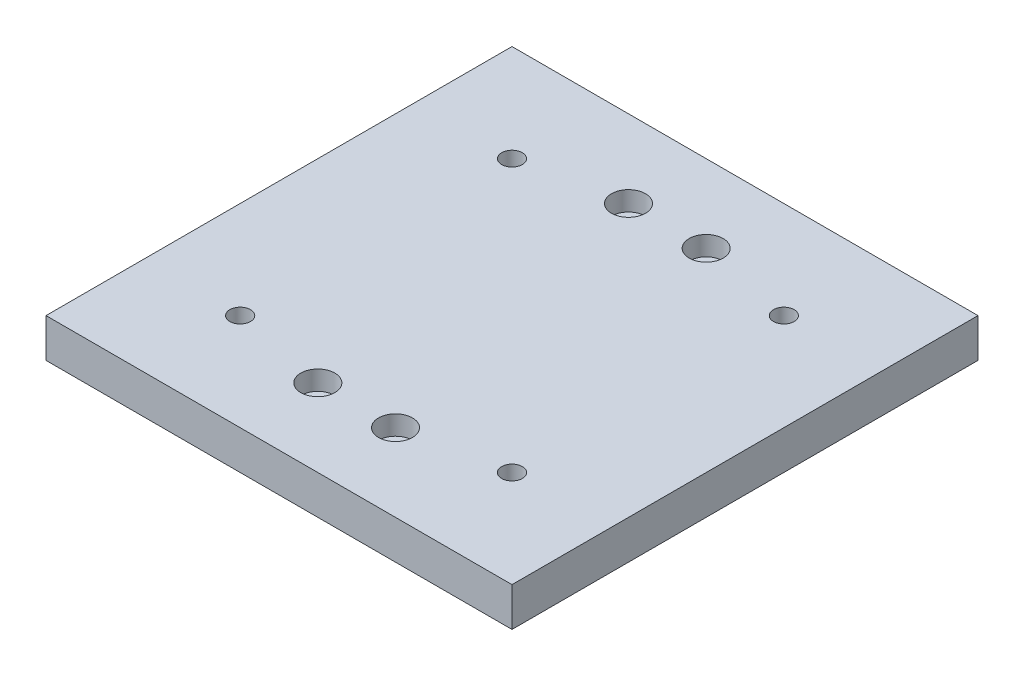
ISO-10303-21;
HEADER;
FILE_DESCRIPTION(('STEP AP214'),'2;1');
FILE_NAME('part.step','',(''),(''),'','','');
FILE_SCHEMA(('AUTOMOTIVE_DESIGN { 1 0 10303 214 1 1 1 1 }'));
ENDSEC;
DATA;
#1=APPLICATION_CONTEXT('core data for automotive mechanical design processes');
#2=APPLICATION_PROTOCOL_DEFINITION('international standard','automotive_design',2000,#1);
#3=PRODUCT_CONTEXT('',#1,'mechanical');
#4=PRODUCT('Part','Part','',(#3));
#5=PRODUCT_RELATED_PRODUCT_CATEGORY('part','',(#4));
#6=PRODUCT_DEFINITION_FORMATION('','',#4);
#7=PRODUCT_DEFINITION_CONTEXT('part definition',#1,'design');
#8=PRODUCT_DEFINITION('design','',#6,#7);
#9=PRODUCT_DEFINITION_SHAPE('','',#8);
#10=(LENGTH_UNIT() NAMED_UNIT(*) SI_UNIT(.MILLI.,.METRE.));
#11=(NAMED_UNIT(*) PLANE_ANGLE_UNIT() SI_UNIT($,.RADIAN.));
#12=(NAMED_UNIT(*) SI_UNIT($,.STERADIAN.) SOLID_ANGLE_UNIT());
#13=UNCERTAINTY_MEASURE_WITH_UNIT(LENGTH_MEASURE(1.E-05),#10,'distance_accuracy_value','');
#14=(GEOMETRIC_REPRESENTATION_CONTEXT(3) GLOBAL_UNCERTAINTY_ASSIGNED_CONTEXT((#13)) GLOBAL_UNIT_ASSIGNED_CONTEXT((#10,
#11,#12)) REPRESENTATION_CONTEXT('',''));
#15=CARTESIAN_POINT('',(0.,0.,0.));
#16=DIRECTION('',(0.,0.,1.));
#17=DIRECTION('',(1.,0.,0.));
#18=AXIS2_PLACEMENT_3D('',#15,#16,#17);
#19=CARTESIAN_POINT('',(-76.2,12.7,-76.2));
#20=DIRECTION('',(1.,0.,0.));
#21=DIRECTION('',(0.,0.,-1.));
#22=AXIS2_PLACEMENT_3D('',#19,#20,#21);
#23=PLANE('',#22);
#24=DIRECTION('',(0.,0.,1.));
#25=VECTOR('',#24,1.);
#26=CARTESIAN_POINT('',(-76.2,0.,-76.2));
#27=LINE('',#26,#25);
#28=CARTESIAN_POINT('',(-76.2,0.,-76.2));
#29=VERTEX_POINT('',#28);
#30=CARTESIAN_POINT('',(-76.2,0.,76.2));
#31=VERTEX_POINT('',#30);
#32=EDGE_CURVE('E100',#29,#31,#27,.T.);
#33=ORIENTED_EDGE('',*,*,#32,.T.);
#34=DIRECTION('',(0.,-1.,0.));
#35=VECTOR('',#34,1.);
#36=CARTESIAN_POINT('',(-76.2,12.7,76.2));
#37=LINE('',#36,#35);
#38=CARTESIAN_POINT('',(-76.2,12.7,76.2));
#39=VERTEX_POINT('',#38);
#40=EDGE_CURVE('E11',#39,#31,#37,.T.);
#41=ORIENTED_EDGE('',*,*,#40,.F.);
#42=DIRECTION('',(0.,0.,1.));
#43=VECTOR('',#42,1.);
#44=CARTESIAN_POINT('',(-76.2,12.7,-76.2));
#45=LINE('',#44,#43);
#46=CARTESIAN_POINT('',(-76.2,12.7,-76.2));
#47=VERTEX_POINT('',#46);
#48=EDGE_CURVE('E88',#47,#39,#45,.T.);
#49=ORIENTED_EDGE('',*,*,#48,.F.);
#50=DIRECTION('',(0.,-1.,0.));
#51=VECTOR('',#50,1.);
#52=CARTESIAN_POINT('',(-76.2,12.7,-76.2));
#53=LINE('',#52,#51);
#54=EDGE_CURVE('E96',#47,#29,#53,.T.);
#55=ORIENTED_EDGE('',*,*,#54,.T.);
#56=EDGE_LOOP('',(#33,#41,#49,#55));
#57=FACE_BOUND('',#56,.T.);
#58=ADVANCED_FACE('F37',(#57),#23,.F.);
#59=CARTESIAN_POINT('',(76.2,12.7,76.2));
#60=DIRECTION('',(0.,0.,-1.));
#61=DIRECTION('',(-1.,0.,0.));
#62=AXIS2_PLACEMENT_3D('',#59,#60,#61);
#63=PLANE('',#62);
#64=DIRECTION('',(1.,0.,0.));
#65=VECTOR('',#64,1.);
#66=CARTESIAN_POINT('',(76.2,0.,76.2));
#67=LINE('',#66,#65);
#68=CARTESIAN_POINT('',(76.2,0.,76.2));
#69=VERTEX_POINT('',#68);
#70=EDGE_CURVE('E92',#31,#69,#67,.T.);
#71=ORIENTED_EDGE('',*,*,#70,.T.);
#72=DIRECTION('',(0.,-1.,0.));
#73=VECTOR('',#72,1.);
#74=CARTESIAN_POINT('',(76.2,12.7,76.2));
#75=LINE('',#74,#73);
#76=CARTESIAN_POINT('',(76.2,12.7,76.2));
#77=VERTEX_POINT('',#76);
#78=EDGE_CURVE('E45',#77,#69,#75,.T.);
#79=ORIENTED_EDGE('',*,*,#78,.F.);
#80=DIRECTION('',(1.,0.,0.));
#81=VECTOR('',#80,1.);
#82=CARTESIAN_POINT('',(76.2,12.7,76.2));
#83=LINE('',#82,#81);
#84=EDGE_CURVE('E83',#39,#77,#83,.T.);
#85=ORIENTED_EDGE('',*,*,#84,.F.);
#86=ORIENTED_EDGE('',*,*,#40,.T.);
#87=EDGE_LOOP('',(#71,#79,#85,#86));
#88=FACE_BOUND('',#87,.T.);
#89=ADVANCED_FACE('F91',(#88),#63,.F.);
#90=CARTESIAN_POINT('',(76.2,12.7,-76.2));
#91=DIRECTION('',(-1.,0.,0.));
#92=DIRECTION('',(0.,0.,1.));
#93=AXIS2_PLACEMENT_3D('',#90,#91,#92);
#94=PLANE('',#93);
#95=DIRECTION('',(0.,0.,-1.));
#96=VECTOR('',#95,1.);
#97=CARTESIAN_POINT('',(76.2,0.,-76.2));
#98=LINE('',#97,#96);
#99=CARTESIAN_POINT('',(76.2,0.,-76.2));
#100=VERTEX_POINT('',#99);
#101=EDGE_CURVE('E70',#69,#100,#98,.T.);
#102=ORIENTED_EDGE('',*,*,#101,.T.);
#103=DIRECTION('',(0.,-1.,0.));
#104=VECTOR('',#103,1.);
#105=CARTESIAN_POINT('',(76.2,12.7,-76.2));
#106=LINE('',#105,#104);
#107=CARTESIAN_POINT('',(76.2,12.7,-76.2));
#108=VERTEX_POINT('',#107);
#109=EDGE_CURVE('E93',#108,#100,#106,.T.);
#110=ORIENTED_EDGE('',*,*,#109,.F.);
#111=DIRECTION('',(0.,0.,-1.));
#112=VECTOR('',#111,1.);
#113=CARTESIAN_POINT('',(76.2,12.7,-76.2));
#114=LINE('',#113,#112);
#115=EDGE_CURVE('E86',#77,#108,#114,.T.);
#116=ORIENTED_EDGE('',*,*,#115,.F.);
#117=ORIENTED_EDGE('',*,*,#78,.T.);
#118=EDGE_LOOP('',(#102,#110,#116,#117));
#119=FACE_BOUND('',#118,.T.);
#120=ADVANCED_FACE('F94',(#119),#94,.F.);
#121=CARTESIAN_POINT('',(76.2,12.7,-76.2));
#122=DIRECTION('',(0.,0.,1.));
#123=DIRECTION('',(1.,0.,0.));
#124=AXIS2_PLACEMENT_3D('',#121,#122,#123);
#125=PLANE('',#124);
#126=DIRECTION('',(-1.,0.,0.));
#127=VECTOR('',#126,1.);
#128=CARTESIAN_POINT('',(76.2,0.,-76.2));
#129=LINE('',#128,#127);
#130=EDGE_CURVE('E76',#100,#29,#129,.T.);
#131=ORIENTED_EDGE('',*,*,#130,.T.);
#132=ORIENTED_EDGE('',*,*,#54,.F.);
#133=DIRECTION('',(-1.,0.,0.));
#134=VECTOR('',#133,1.);
#135=CARTESIAN_POINT('',(76.2,12.7,-76.2));
#136=LINE('',#135,#134);
#137=EDGE_CURVE('E53',#108,#47,#136,.T.);
#138=ORIENTED_EDGE('',*,*,#137,.F.);
#139=ORIENTED_EDGE('',*,*,#109,.T.);
#140=EDGE_LOOP('',(#131,#132,#138,#139));
#141=FACE_BOUND('',#140,.T.);
#142=ADVANCED_FACE('F108',(#141),#125,.F.);
#143=CARTESIAN_POINT('',(0.,12.7,0.));
#144=DIRECTION('',(0.,-1.,0.));
#145=DIRECTION('',(0.,0.,-1.));
#146=AXIS2_PLACEMENT_3D('',#143,#144,#145);
#147=PLANE('',#146);
#148=CARTESIAN_POINT('',(44.45,12.7,44.45));
#149=DIRECTION('',(0.,-1.,0.));
#150=DIRECTION('',(0.,0.,-1.));
#151=AXIS2_PLACEMENT_3D('',#148,#149,#150);
#152=CIRCLE('',#151,3.3782);
#153=CARTESIAN_POINT('',(44.45,12.7,41.0718));
#154=VERTEX_POINT('',#153);
#155=EDGE_CURVE('E197',#154,#154,#152,.T.);
#156=ORIENTED_EDGE('',*,*,#155,.T.);
#157=EDGE_LOOP('',(#156));
#158=FACE_BOUND('',#157,.T.);
#159=CARTESIAN_POINT('',(44.45,12.7,-44.45));
#160=DIRECTION('',(0.,-1.,0.));
#161=DIRECTION('',(0.,0.,-1.));
#162=AXIS2_PLACEMENT_3D('',#159,#160,#161);
#163=CIRCLE('',#162,3.3782);
#164=CARTESIAN_POINT('',(44.45,12.7,-47.8282));
#165=VERTEX_POINT('',#164);
#166=EDGE_CURVE('E185',#165,#165,#163,.T.);
#167=ORIENTED_EDGE('',*,*,#166,.T.);
#168=EDGE_LOOP('',(#167));
#169=FACE_BOUND('',#168,.T.);
#170=CARTESIAN_POINT('',(-44.45,12.7,-44.45));
#171=DIRECTION('',(0.,-1.,0.));
#172=DIRECTION('',(0.,0.,-1.));
#173=AXIS2_PLACEMENT_3D('',#170,#171,#172);
#174=CIRCLE('',#173,3.3782);
#175=CARTESIAN_POINT('',(-44.45,12.7,-47.8282));
#176=VERTEX_POINT('',#175);
#177=EDGE_CURVE('E173',#176,#176,#174,.T.);
#178=ORIENTED_EDGE('',*,*,#177,.T.);
#179=EDGE_LOOP('',(#178));
#180=FACE_BOUND('',#179,.T.);
#181=CARTESIAN_POINT('',(-44.45,12.7,44.45));
#182=DIRECTION('',(0.,-1.,0.));
#183=DIRECTION('',(0.,0.,-1.));
#184=AXIS2_PLACEMENT_3D('',#181,#182,#183);
#185=CIRCLE('',#184,3.3782);
#186=CARTESIAN_POINT('',(-44.45,12.7,41.0718));
#187=VERTEX_POINT('',#186);
#188=EDGE_CURVE('E161',#187,#187,#185,.T.);
#189=ORIENTED_EDGE('',*,*,#188,.T.);
#190=EDGE_LOOP('',(#189));
#191=FACE_BOUND('',#190,.T.);
#192=CARTESIAN_POINT('',(-12.7,12.7,50.8));
#193=DIRECTION('',(0.,1.,0.));
#194=DIRECTION('',(0.,0.,1.));
#195=AXIS2_PLACEMENT_3D('',#192,#193,#194);
#196=CIRCLE('',#195,5.55625);
#197=CARTESIAN_POINT('',(-12.7,12.7,56.35625));
#198=VERTEX_POINT('',#197);
#199=EDGE_CURVE('E158',#198,#198,#196,.T.);
#200=ORIENTED_EDGE('',*,*,#199,.F.);
#201=EDGE_LOOP('',(#200));
#202=FACE_BOUND('',#201,.T.);
#203=CARTESIAN_POINT('',(12.7,12.7,50.8));
#204=DIRECTION('',(0.,1.,0.));
#205=DIRECTION('',(0.,0.,1.));
#206=AXIS2_PLACEMENT_3D('',#203,#204,#205);
#207=CIRCLE('',#206,5.55625);
#208=CARTESIAN_POINT('',(12.7,12.7,56.35625));
#209=VERTEX_POINT('',#208);
#210=EDGE_CURVE('E146',#209,#209,#207,.T.);
#211=ORIENTED_EDGE('',*,*,#210,.F.);
#212=EDGE_LOOP('',(#211));
#213=FACE_BOUND('',#212,.T.);
#214=CARTESIAN_POINT('',(12.7,12.7,-50.8));
#215=DIRECTION('',(0.,1.,0.));
#216=DIRECTION('',(0.,0.,1.));
#217=AXIS2_PLACEMENT_3D('',#214,#215,#216);
#218=CIRCLE('',#217,5.55625);
#219=CARTESIAN_POINT('',(12.7,12.7,-45.24375));
#220=VERTEX_POINT('',#219);
#221=EDGE_CURVE('E134',#220,#220,#218,.T.);
#222=ORIENTED_EDGE('',*,*,#221,.F.);
#223=EDGE_LOOP('',(#222));
#224=FACE_BOUND('',#223,.T.);
#225=CARTESIAN_POINT('',(-12.7,12.7,-50.8));
#226=DIRECTION('',(0.,1.,0.));
#227=DIRECTION('',(0.,0.,1.));
#228=AXIS2_PLACEMENT_3D('',#225,#226,#227);
#229=CIRCLE('',#228,5.55625);
#230=CARTESIAN_POINT('',(-12.7,12.7,-45.24375));
#231=VERTEX_POINT('',#230);
#232=EDGE_CURVE('E122',#231,#231,#229,.T.);
#233=ORIENTED_EDGE('',*,*,#232,.F.);
#234=EDGE_LOOP('',(#233));
#235=FACE_BOUND('',#234,.T.);
#236=ORIENTED_EDGE('',*,*,#48,.T.);
#237=ORIENTED_EDGE('',*,*,#84,.T.);
#238=ORIENTED_EDGE('',*,*,#115,.T.);
#239=ORIENTED_EDGE('',*,*,#137,.T.);
#240=EDGE_LOOP('',(#236,#237,#238,#239));
#241=FACE_BOUND('',#240,.T.);
#242=ADVANCED_FACE('F84',(#158,#169,#180,#191,#202,#213,#224,#235,#241),#147,.F.);
#243=CARTESIAN_POINT('',(0.,0.,0.));
#244=DIRECTION('',(0.,-1.,0.));
#245=DIRECTION('',(0.,0.,-1.));
#246=AXIS2_PLACEMENT_3D('',#243,#244,#245);
#247=PLANE('',#246);
#248=CARTESIAN_POINT('',(44.45,0.,44.45));
#249=DIRECTION('',(0.,-1.,0.));
#250=DIRECTION('',(0.,0.,-1.));
#251=AXIS2_PLACEMENT_3D('',#248,#249,#250);
#252=CIRCLE('',#251,5.55625);
#253=CARTESIAN_POINT('',(44.45,0.,38.89375));
#254=VERTEX_POINT('',#253);
#255=EDGE_CURVE('E206',#254,#254,#252,.T.);
#256=ORIENTED_EDGE('',*,*,#255,.F.);
#257=EDGE_LOOP('',(#256));
#258=FACE_BOUND('',#257,.T.);
#259=CARTESIAN_POINT('',(44.45,0.,-44.45));
#260=DIRECTION('',(0.,-1.,0.));
#261=DIRECTION('',(0.,0.,-1.));
#262=AXIS2_PLACEMENT_3D('',#259,#260,#261);
#263=CIRCLE('',#262,5.55625);
#264=CARTESIAN_POINT('',(44.45,0.,-50.00625));
#265=VERTEX_POINT('',#264);
#266=EDGE_CURVE('E194',#265,#265,#263,.T.);
#267=ORIENTED_EDGE('',*,*,#266,.F.);
#268=EDGE_LOOP('',(#267));
#269=FACE_BOUND('',#268,.T.);
#270=CARTESIAN_POINT('',(-44.45,0.,-44.45));
#271=DIRECTION('',(0.,-1.,0.));
#272=DIRECTION('',(0.,0.,-1.));
#273=AXIS2_PLACEMENT_3D('',#270,#271,#272);
#274=CIRCLE('',#273,5.55625);
#275=CARTESIAN_POINT('',(-44.45,0.,-50.00625));
#276=VERTEX_POINT('',#275);
#277=EDGE_CURVE('E182',#276,#276,#274,.T.);
#278=ORIENTED_EDGE('',*,*,#277,.F.);
#279=EDGE_LOOP('',(#278));
#280=FACE_BOUND('',#279,.T.);
#281=CARTESIAN_POINT('',(-44.45,0.,44.45));
#282=DIRECTION('',(0.,-1.,0.));
#283=DIRECTION('',(0.,0.,-1.));
#284=AXIS2_PLACEMENT_3D('',#281,#282,#283);
#285=CIRCLE('',#284,5.55625);
#286=CARTESIAN_POINT('',(-44.45,0.,38.89375));
#287=VERTEX_POINT('',#286);
#288=EDGE_CURVE('E170',#287,#287,#285,.T.);
#289=ORIENTED_EDGE('',*,*,#288,.F.);
#290=EDGE_LOOP('',(#289));
#291=FACE_BOUND('',#290,.T.);
#292=CARTESIAN_POINT('',(-12.7,0.,50.8));
#293=DIRECTION('',(0.,1.,0.));
#294=DIRECTION('',(0.,0.,1.));
#295=AXIS2_PLACEMENT_3D('',#292,#293,#294);
#296=CIRCLE('',#295,3.3782);
#297=CARTESIAN_POINT('',(-12.7,0.,54.1782));
#298=VERTEX_POINT('',#297);
#299=EDGE_CURVE('E149',#298,#298,#296,.T.);
#300=ORIENTED_EDGE('',*,*,#299,.T.);
#301=EDGE_LOOP('',(#300));
#302=FACE_BOUND('',#301,.T.);
#303=CARTESIAN_POINT('',(12.7,0.,50.8));
#304=DIRECTION('',(0.,1.,0.));
#305=DIRECTION('',(0.,0.,1.));
#306=AXIS2_PLACEMENT_3D('',#303,#304,#305);
#307=CIRCLE('',#306,3.3782);
#308=CARTESIAN_POINT('',(12.7,0.,54.1782));
#309=VERTEX_POINT('',#308);
#310=EDGE_CURVE('E137',#309,#309,#307,.T.);
#311=ORIENTED_EDGE('',*,*,#310,.T.);
#312=EDGE_LOOP('',(#311));
#313=FACE_BOUND('',#312,.T.);
#314=CARTESIAN_POINT('',(12.7,0.,-50.8));
#315=DIRECTION('',(0.,1.,0.));
#316=DIRECTION('',(0.,0.,1.));
#317=AXIS2_PLACEMENT_3D('',#314,#315,#316);
#318=CIRCLE('',#317,3.3782);
#319=CARTESIAN_POINT('',(12.7,0.,-47.4218));
#320=VERTEX_POINT('',#319);
#321=EDGE_CURVE('E125',#320,#320,#318,.T.);
#322=ORIENTED_EDGE('',*,*,#321,.T.);
#323=EDGE_LOOP('',(#322));
#324=FACE_BOUND('',#323,.T.);
#325=CARTESIAN_POINT('',(-12.7,0.,-50.8));
#326=DIRECTION('',(0.,1.,0.));
#327=DIRECTION('',(0.,0.,1.));
#328=AXIS2_PLACEMENT_3D('',#325,#326,#327);
#329=CIRCLE('',#328,3.3782);
#330=CARTESIAN_POINT('',(-12.7,0.,-47.4218));
#331=VERTEX_POINT('',#330);
#332=EDGE_CURVE('E103',#331,#331,#329,.T.);
#333=ORIENTED_EDGE('',*,*,#332,.T.);
#334=EDGE_LOOP('',(#333));
#335=FACE_BOUND('',#334,.T.);
#336=ORIENTED_EDGE('',*,*,#32,.F.);
#337=ORIENTED_EDGE('',*,*,#130,.F.);
#338=ORIENTED_EDGE('',*,*,#101,.F.);
#339=ORIENTED_EDGE('',*,*,#70,.F.);
#340=EDGE_LOOP('',(#336,#337,#338,#339));
#341=FACE_BOUND('',#340,.T.);
#342=ADVANCED_FACE('F111',(#258,#269,#280,#291,#302,#313,#324,#335,#341),#247,.T.);
#343=CARTESIAN_POINT('',(-12.7,12.7,-50.8));
#344=DIRECTION('',(0.,1.,0.));
#345=DIRECTION('',(0.,0.,1.));
#346=AXIS2_PLACEMENT_3D('',#343,#344,#345);
#347=CYLINDRICAL_SURFACE('',#346,3.3782);
#348=ORIENTED_EDGE('',*,*,#332,.F.);
#349=EDGE_LOOP('',(#348));
#350=FACE_BOUND('',#349,.T.);
#351=CARTESIAN_POINT('',(-12.7,6.35,-50.8));
#352=DIRECTION('',(0.,1.,0.));
#353=DIRECTION('',(0.,0.,1.));
#354=AXIS2_PLACEMENT_3D('',#351,#352,#353);
#355=CIRCLE('',#354,3.3782);
#356=CARTESIAN_POINT('',(-12.7,6.35,-47.4218));
#357=VERTEX_POINT('',#356);
#358=EDGE_CURVE('E116',#357,#357,#355,.T.);
#359=ORIENTED_EDGE('',*,*,#358,.T.);
#360=EDGE_LOOP('',(#359));
#361=FACE_BOUND('',#360,.T.);
#362=ADVANCED_FACE('F214',(#350,#361),#347,.F.);
#363=CARTESIAN_POINT('',(-9.3218,6.35,-50.8));
#364=DIRECTION('',(0.,-1.,0.));
#365=DIRECTION('',(0.,0.,-1.));
#366=AXIS2_PLACEMENT_3D('',#363,#364,#365);
#367=PLANE('',#366);
#368=ORIENTED_EDGE('',*,*,#358,.F.);
#369=EDGE_LOOP('',(#368));
#370=FACE_BOUND('',#369,.T.);
#371=CARTESIAN_POINT('',(-12.7,6.35,-50.8));
#372=DIRECTION('',(0.,1.,0.));
#373=DIRECTION('',(0.,0.,1.));
#374=AXIS2_PLACEMENT_3D('',#371,#372,#373);
#375=CIRCLE('',#374,5.55625);
#376=CARTESIAN_POINT('',(-12.7,6.35,-45.24375));
#377=VERTEX_POINT('',#376);
#378=EDGE_CURVE('E119',#377,#377,#375,.T.);
#379=ORIENTED_EDGE('',*,*,#378,.T.);
#380=EDGE_LOOP('',(#379));
#381=FACE_BOUND('',#380,.T.);
#382=ADVANCED_FACE('F232',(#370,#381),#367,.F.);
#383=CARTESIAN_POINT('',(-12.7,12.7,-50.8));
#384=DIRECTION('',(0.,1.,0.));
#385=DIRECTION('',(0.,0.,1.));
#386=AXIS2_PLACEMENT_3D('',#383,#384,#385);
#387=CYLINDRICAL_SURFACE('',#386,5.55625);
#388=ORIENTED_EDGE('',*,*,#378,.F.);
#389=EDGE_LOOP('',(#388));
#390=FACE_BOUND('',#389,.T.);
#391=ORIENTED_EDGE('',*,*,#232,.T.);
#392=EDGE_LOOP('',(#391));
#393=FACE_BOUND('',#392,.T.);
#394=ADVANCED_FACE('F238',(#390,#393),#387,.F.);
#395=CARTESIAN_POINT('',(12.7,12.7,-50.8));
#396=DIRECTION('',(0.,1.,0.));
#397=DIRECTION('',(0.,0.,1.));
#398=AXIS2_PLACEMENT_3D('',#395,#396,#397);
#399=CYLINDRICAL_SURFACE('',#398,3.3782);
#400=ORIENTED_EDGE('',*,*,#321,.F.);
#401=EDGE_LOOP('',(#400));
#402=FACE_BOUND('',#401,.T.);
#403=CARTESIAN_POINT('',(12.7,6.35,-50.8));
#404=DIRECTION('',(0.,1.,0.));
#405=DIRECTION('',(0.,0.,1.));
#406=AXIS2_PLACEMENT_3D('',#403,#404,#405);
#407=CIRCLE('',#406,3.3782);
#408=CARTESIAN_POINT('',(12.7,6.35,-47.4218));
#409=VERTEX_POINT('',#408);
#410=EDGE_CURVE('E128',#409,#409,#407,.T.);
#411=ORIENTED_EDGE('',*,*,#410,.T.);
#412=EDGE_LOOP('',(#411));
#413=FACE_BOUND('',#412,.T.);
#414=ADVANCED_FACE('F244',(#402,#413),#399,.F.);
#415=CARTESIAN_POINT('',(16.0782,6.35,-50.8));
#416=DIRECTION('',(0.,-1.,0.));
#417=DIRECTION('',(0.,0.,-1.));
#418=AXIS2_PLACEMENT_3D('',#415,#416,#417);
#419=PLANE('',#418);
#420=ORIENTED_EDGE('',*,*,#410,.F.);
#421=EDGE_LOOP('',(#420));
#422=FACE_BOUND('',#421,.T.);
#423=CARTESIAN_POINT('',(12.7,6.35,-50.8));
#424=DIRECTION('',(0.,1.,0.));
#425=DIRECTION('',(0.,0.,1.));
#426=AXIS2_PLACEMENT_3D('',#423,#424,#425);
#427=CIRCLE('',#426,5.55625);
#428=CARTESIAN_POINT('',(12.7,6.35,-45.24375));
#429=VERTEX_POINT('',#428);
#430=EDGE_CURVE('E131',#429,#429,#427,.T.);
#431=ORIENTED_EDGE('',*,*,#430,.T.);
#432=EDGE_LOOP('',(#431));
#433=FACE_BOUND('',#432,.T.);
#434=ADVANCED_FACE('F299',(#422,#433),#419,.F.);
#435=CARTESIAN_POINT('',(12.7,12.7,-50.8));
#436=DIRECTION('',(0.,1.,0.));
#437=DIRECTION('',(0.,0.,1.));
#438=AXIS2_PLACEMENT_3D('',#435,#436,#437);
#439=CYLINDRICAL_SURFACE('',#438,5.55625);
#440=ORIENTED_EDGE('',*,*,#430,.F.);
#441=EDGE_LOOP('',(#440));
#442=FACE_BOUND('',#441,.T.);
#443=ORIENTED_EDGE('',*,*,#221,.T.);
#444=EDGE_LOOP('',(#443));
#445=FACE_BOUND('',#444,.T.);
#446=ADVANCED_FACE('F309',(#442,#445),#439,.F.);
#447=CARTESIAN_POINT('',(12.7,12.7,50.8));
#448=DIRECTION('',(0.,1.,0.));
#449=DIRECTION('',(0.,0.,1.));
#450=AXIS2_PLACEMENT_3D('',#447,#448,#449);
#451=CYLINDRICAL_SURFACE('',#450,3.3782);
#452=ORIENTED_EDGE('',*,*,#310,.F.);
#453=EDGE_LOOP('',(#452));
#454=FACE_BOUND('',#453,.T.);
#455=CARTESIAN_POINT('',(12.7,6.35,50.8));
#456=DIRECTION('',(0.,1.,0.));
#457=DIRECTION('',(0.,0.,1.));
#458=AXIS2_PLACEMENT_3D('',#455,#456,#457);
#459=CIRCLE('',#458,3.3782);
#460=CARTESIAN_POINT('',(12.7,6.35,54.1782));
#461=VERTEX_POINT('',#460);
#462=EDGE_CURVE('E140',#461,#461,#459,.T.);
#463=ORIENTED_EDGE('',*,*,#462,.T.);
#464=EDGE_LOOP('',(#463));
#465=FACE_BOUND('',#464,.T.);
#466=ADVANCED_FACE('F319',(#454,#465),#451,.F.);
#467=CARTESIAN_POINT('',(16.0782,6.35,50.8));
#468=DIRECTION('',(0.,-1.,0.));
#469=DIRECTION('',(0.,0.,-1.));
#470=AXIS2_PLACEMENT_3D('',#467,#468,#469);
#471=PLANE('',#470);
#472=ORIENTED_EDGE('',*,*,#462,.F.);
#473=EDGE_LOOP('',(#472));
#474=FACE_BOUND('',#473,.T.);
#475=CARTESIAN_POINT('',(12.7,6.35,50.8));
#476=DIRECTION('',(0.,1.,0.));
#477=DIRECTION('',(0.,0.,1.));
#478=AXIS2_PLACEMENT_3D('',#475,#476,#477);
#479=CIRCLE('',#478,5.55625);
#480=CARTESIAN_POINT('',(12.7,6.35,56.35625));
#481=VERTEX_POINT('',#480);
#482=EDGE_CURVE('E143',#481,#481,#479,.T.);
#483=ORIENTED_EDGE('',*,*,#482,.T.);
#484=EDGE_LOOP('',(#483));
#485=FACE_BOUND('',#484,.T.);
#486=ADVANCED_FACE('F329',(#474,#485),#471,.F.);
#487=CARTESIAN_POINT('',(12.7,12.7,50.8));
#488=DIRECTION('',(0.,1.,0.));
#489=DIRECTION('',(0.,0.,1.));
#490=AXIS2_PLACEMENT_3D('',#487,#488,#489);
#491=CYLINDRICAL_SURFACE('',#490,5.55625);
#492=ORIENTED_EDGE('',*,*,#482,.F.);
#493=EDGE_LOOP('',(#492));
#494=FACE_BOUND('',#493,.T.);
#495=ORIENTED_EDGE('',*,*,#210,.T.);
#496=EDGE_LOOP('',(#495));
#497=FACE_BOUND('',#496,.T.);
#498=ADVANCED_FACE('F339',(#494,#497),#491,.F.);
#499=CARTESIAN_POINT('',(-12.7,12.7,50.8));
#500=DIRECTION('',(0.,1.,0.));
#501=DIRECTION('',(0.,0.,1.));
#502=AXIS2_PLACEMENT_3D('',#499,#500,#501);
#503=CYLINDRICAL_SURFACE('',#502,3.3782);
#504=ORIENTED_EDGE('',*,*,#299,.F.);
#505=EDGE_LOOP('',(#504));
#506=FACE_BOUND('',#505,.T.);
#507=CARTESIAN_POINT('',(-12.7,6.35,50.8));
#508=DIRECTION('',(0.,1.,0.));
#509=DIRECTION('',(0.,0.,1.));
#510=AXIS2_PLACEMENT_3D('',#507,#508,#509);
#511=CIRCLE('',#510,3.3782);
#512=CARTESIAN_POINT('',(-12.7,6.35,54.1782));
#513=VERTEX_POINT('',#512);
#514=EDGE_CURVE('E152',#513,#513,#511,.T.);
#515=ORIENTED_EDGE('',*,*,#514,.T.);
#516=EDGE_LOOP('',(#515));
#517=FACE_BOUND('',#516,.T.);
#518=ADVANCED_FACE('F349',(#506,#517),#503,.F.);
#519=CARTESIAN_POINT('',(-9.3218,6.35,50.8));
#520=DIRECTION('',(0.,-1.,0.));
#521=DIRECTION('',(0.,0.,-1.));
#522=AXIS2_PLACEMENT_3D('',#519,#520,#521);
#523=PLANE('',#522);
#524=ORIENTED_EDGE('',*,*,#514,.F.);
#525=EDGE_LOOP('',(#524));
#526=FACE_BOUND('',#525,.T.);
#527=CARTESIAN_POINT('',(-12.7,6.35,50.8));
#528=DIRECTION('',(0.,1.,0.));
#529=DIRECTION('',(0.,0.,1.));
#530=AXIS2_PLACEMENT_3D('',#527,#528,#529);
#531=CIRCLE('',#530,5.55625);
#532=CARTESIAN_POINT('',(-12.7,6.35,56.35625));
#533=VERTEX_POINT('',#532);
#534=EDGE_CURVE('E155',#533,#533,#531,.T.);
#535=ORIENTED_EDGE('',*,*,#534,.T.);
#536=EDGE_LOOP('',(#535));
#537=FACE_BOUND('',#536,.T.);
#538=ADVANCED_FACE('F359',(#526,#537),#523,.F.);
#539=CARTESIAN_POINT('',(-12.7,12.7,50.8));
#540=DIRECTION('',(0.,1.,0.));
#541=DIRECTION('',(0.,0.,1.));
#542=AXIS2_PLACEMENT_3D('',#539,#540,#541);
#543=CYLINDRICAL_SURFACE('',#542,5.55625);
#544=ORIENTED_EDGE('',*,*,#534,.F.);
#545=EDGE_LOOP('',(#544));
#546=FACE_BOUND('',#545,.T.);
#547=ORIENTED_EDGE('',*,*,#199,.T.);
#548=EDGE_LOOP('',(#547));
#549=FACE_BOUND('',#548,.T.);
#550=ADVANCED_FACE('F369',(#546,#549),#543,.F.);
#551=CARTESIAN_POINT('',(-44.45,0.,44.45));
#552=DIRECTION('',(0.,-1.,0.));
#553=DIRECTION('',(0.,0.,-1.));
#554=AXIS2_PLACEMENT_3D('',#551,#552,#553);
#555=CYLINDRICAL_SURFACE('',#554,3.3782);
#556=ORIENTED_EDGE('',*,*,#188,.F.);
#557=EDGE_LOOP('',(#556));
#558=FACE_BOUND('',#557,.T.);
#559=CARTESIAN_POINT('',(-44.45,6.35,44.45));
#560=DIRECTION('',(0.,-1.,0.));
#561=DIRECTION('',(0.,0.,-1.));
#562=AXIS2_PLACEMENT_3D('',#559,#560,#561);
#563=CIRCLE('',#562,3.3782);
#564=CARTESIAN_POINT('',(-44.45,6.35,41.0718));
#565=VERTEX_POINT('',#564);
#566=EDGE_CURVE('E164',#565,#565,#563,.T.);
#567=ORIENTED_EDGE('',*,*,#566,.T.);
#568=EDGE_LOOP('',(#567));
#569=FACE_BOUND('',#568,.T.);
#570=ADVANCED_FACE('F378',(#558,#569),#555,.F.);
#571=CARTESIAN_POINT('',(-41.0718,6.35,44.45));
#572=DIRECTION('',(0.,1.,0.));
#573=DIRECTION('',(0.,0.,1.));
#574=AXIS2_PLACEMENT_3D('',#571,#572,#573);
#575=PLANE('',#574);
#576=ORIENTED_EDGE('',*,*,#566,.F.);
#577=EDGE_LOOP('',(#576));
#578=FACE_BOUND('',#577,.T.);
#579=CARTESIAN_POINT('',(-44.45,6.35,44.45));
#580=DIRECTION('',(0.,-1.,0.));
#581=DIRECTION('',(0.,0.,-1.));
#582=AXIS2_PLACEMENT_3D('',#579,#580,#581);
#583=CIRCLE('',#582,5.55625);
#584=CARTESIAN_POINT('',(-44.45,6.35,38.89375));
#585=VERTEX_POINT('',#584);
#586=EDGE_CURVE('E167',#585,#585,#583,.T.);
#587=ORIENTED_EDGE('',*,*,#586,.T.);
#588=EDGE_LOOP('',(#587));
#589=FACE_BOUND('',#588,.T.);
#590=ADVANCED_FACE('F397',(#578,#589),#575,.F.);
#591=CARTESIAN_POINT('',(-44.45,0.,44.45));
#592=DIRECTION('',(0.,-1.,0.));
#593=DIRECTION('',(0.,0.,-1.));
#594=AXIS2_PLACEMENT_3D('',#591,#592,#593);
#595=CYLINDRICAL_SURFACE('',#594,5.55625);
#596=ORIENTED_EDGE('',*,*,#586,.F.);
#597=EDGE_LOOP('',(#596));
#598=FACE_BOUND('',#597,.T.);
#599=ORIENTED_EDGE('',*,*,#288,.T.);
#600=EDGE_LOOP('',(#599));
#601=FACE_BOUND('',#600,.T.);
#602=ADVANCED_FACE('F407',(#598,#601),#595,.F.);
#603=CARTESIAN_POINT('',(-44.45,0.,-44.45));
#604=DIRECTION('',(0.,-1.,0.));
#605=DIRECTION('',(0.,0.,-1.));
#606=AXIS2_PLACEMENT_3D('',#603,#604,#605);
#607=CYLINDRICAL_SURFACE('',#606,3.3782);
#608=ORIENTED_EDGE('',*,*,#177,.F.);
#609=EDGE_LOOP('',(#608));
#610=FACE_BOUND('',#609,.T.);
#611=CARTESIAN_POINT('',(-44.45,6.35,-44.45));
#612=DIRECTION('',(0.,-1.,0.));
#613=DIRECTION('',(0.,0.,-1.));
#614=AXIS2_PLACEMENT_3D('',#611,#612,#613);
#615=CIRCLE('',#614,3.3782);
#616=CARTESIAN_POINT('',(-44.45,6.35,-47.8282));
#617=VERTEX_POINT('',#616);
#618=EDGE_CURVE('E176',#617,#617,#615,.T.);
#619=ORIENTED_EDGE('',*,*,#618,.T.);
#620=EDGE_LOOP('',(#619));
#621=FACE_BOUND('',#620,.T.);
#622=ADVANCED_FACE('F417',(#610,#621),#607,.F.);
#623=CARTESIAN_POINT('',(-41.0718,6.35,-44.45));
#624=DIRECTION('',(0.,1.,0.));
#625=DIRECTION('',(0.,0.,1.));
#626=AXIS2_PLACEMENT_3D('',#623,#624,#625);
#627=PLANE('',#626);
#628=ORIENTED_EDGE('',*,*,#618,.F.);
#629=EDGE_LOOP('',(#628));
#630=FACE_BOUND('',#629,.T.);
#631=CARTESIAN_POINT('',(-44.45,6.35,-44.45));
#632=DIRECTION('',(0.,-1.,0.));
#633=DIRECTION('',(0.,0.,-1.));
#634=AXIS2_PLACEMENT_3D('',#631,#632,#633);
#635=CIRCLE('',#634,5.55625);
#636=CARTESIAN_POINT('',(-44.45,6.35,-50.00625));
#637=VERTEX_POINT('',#636);
#638=EDGE_CURVE('E179',#637,#637,#635,.T.);
#639=ORIENTED_EDGE('',*,*,#638,.T.);
#640=EDGE_LOOP('',(#639));
#641=FACE_BOUND('',#640,.T.);
#642=ADVANCED_FACE('F427',(#630,#641),#627,.F.);
#643=CARTESIAN_POINT('',(-44.45,0.,-44.45));
#644=DIRECTION('',(0.,-1.,0.));
#645=DIRECTION('',(0.,0.,-1.));
#646=AXIS2_PLACEMENT_3D('',#643,#644,#645);
#647=CYLINDRICAL_SURFACE('',#646,5.55625);
#648=ORIENTED_EDGE('',*,*,#638,.F.);
#649=EDGE_LOOP('',(#648));
#650=FACE_BOUND('',#649,.T.);
#651=ORIENTED_EDGE('',*,*,#277,.T.);
#652=EDGE_LOOP('',(#651));
#653=FACE_BOUND('',#652,.T.);
#654=ADVANCED_FACE('F437',(#650,#653),#647,.F.);
#655=CARTESIAN_POINT('',(44.45,0.,-44.45));
#656=DIRECTION('',(0.,-1.,0.));
#657=DIRECTION('',(0.,0.,-1.));
#658=AXIS2_PLACEMENT_3D('',#655,#656,#657);
#659=CYLINDRICAL_SURFACE('',#658,3.3782);
#660=ORIENTED_EDGE('',*,*,#166,.F.);
#661=EDGE_LOOP('',(#660));
#662=FACE_BOUND('',#661,.T.);
#663=CARTESIAN_POINT('',(44.45,6.35,-44.45));
#664=DIRECTION('',(0.,-1.,0.));
#665=DIRECTION('',(0.,0.,-1.));
#666=AXIS2_PLACEMENT_3D('',#663,#664,#665);
#667=CIRCLE('',#666,3.3782);
#668=CARTESIAN_POINT('',(44.45,6.35,-47.8282));
#669=VERTEX_POINT('',#668);
#670=EDGE_CURVE('E188',#669,#669,#667,.T.);
#671=ORIENTED_EDGE('',*,*,#670,.T.);
#672=EDGE_LOOP('',(#671));
#673=FACE_BOUND('',#672,.T.);
#674=ADVANCED_FACE('F447',(#662,#673),#659,.F.);
#675=CARTESIAN_POINT('',(47.8282,6.35,-44.45));
#676=DIRECTION('',(0.,1.,0.));
#677=DIRECTION('',(0.,0.,1.));
#678=AXIS2_PLACEMENT_3D('',#675,#676,#677);
#679=PLANE('',#678);
#680=ORIENTED_EDGE('',*,*,#670,.F.);
#681=EDGE_LOOP('',(#680));
#682=FACE_BOUND('',#681,.T.);
#683=CARTESIAN_POINT('',(44.45,6.35,-44.45));
#684=DIRECTION('',(0.,-1.,0.));
#685=DIRECTION('',(0.,0.,-1.));
#686=AXIS2_PLACEMENT_3D('',#683,#684,#685);
#687=CIRCLE('',#686,5.55625);
#688=CARTESIAN_POINT('',(44.45,6.35,-50.00625));
#689=VERTEX_POINT('',#688);
#690=EDGE_CURVE('E191',#689,#689,#687,.T.);
#691=ORIENTED_EDGE('',*,*,#690,.T.);
#692=EDGE_LOOP('',(#691));
#693=FACE_BOUND('',#692,.T.);
#694=ADVANCED_FACE('F457',(#682,#693),#679,.F.);
#695=CARTESIAN_POINT('',(44.45,0.,-44.45));
#696=DIRECTION('',(0.,-1.,0.));
#697=DIRECTION('',(0.,0.,-1.));
#698=AXIS2_PLACEMENT_3D('',#695,#696,#697);
#699=CYLINDRICAL_SURFACE('',#698,5.55625);
#700=ORIENTED_EDGE('',*,*,#690,.F.);
#701=EDGE_LOOP('',(#700));
#702=FACE_BOUND('',#701,.T.);
#703=ORIENTED_EDGE('',*,*,#266,.T.);
#704=EDGE_LOOP('',(#703));
#705=FACE_BOUND('',#704,.T.);
#706=ADVANCED_FACE('F467',(#702,#705),#699,.F.);
#707=CARTESIAN_POINT('',(44.45,0.,44.45));
#708=DIRECTION('',(0.,-1.,0.));
#709=DIRECTION('',(0.,0.,-1.));
#710=AXIS2_PLACEMENT_3D('',#707,#708,#709);
#711=CYLINDRICAL_SURFACE('',#710,3.3782);
#712=ORIENTED_EDGE('',*,*,#155,.F.);
#713=EDGE_LOOP('',(#712));
#714=FACE_BOUND('',#713,.T.);
#715=CARTESIAN_POINT('',(44.45,6.35,44.45));
#716=DIRECTION('',(0.,-1.,0.));
#717=DIRECTION('',(0.,0.,-1.));
#718=AXIS2_PLACEMENT_3D('',#715,#716,#717);
#719=CIRCLE('',#718,3.3782);
#720=CARTESIAN_POINT('',(44.45,6.35,41.0718));
#721=VERTEX_POINT('',#720);
#722=EDGE_CURVE('E200',#721,#721,#719,.T.);
#723=ORIENTED_EDGE('',*,*,#722,.T.);
#724=EDGE_LOOP('',(#723));
#725=FACE_BOUND('',#724,.T.);
#726=ADVANCED_FACE('F477',(#714,#725),#711,.F.);
#727=CARTESIAN_POINT('',(47.8282,6.35,44.45));
#728=DIRECTION('',(0.,1.,0.));
#729=DIRECTION('',(0.,0.,1.));
#730=AXIS2_PLACEMENT_3D('',#727,#728,#729);
#731=PLANE('',#730);
#732=ORIENTED_EDGE('',*,*,#722,.F.);
#733=EDGE_LOOP('',(#732));
#734=FACE_BOUND('',#733,.T.);
#735=CARTESIAN_POINT('',(44.45,6.35,44.45));
#736=DIRECTION('',(0.,-1.,0.));
#737=DIRECTION('',(0.,0.,-1.));
#738=AXIS2_PLACEMENT_3D('',#735,#736,#737);
#739=CIRCLE('',#738,5.55625);
#740=CARTESIAN_POINT('',(44.45,6.35,38.89375));
#741=VERTEX_POINT('',#740);
#742=EDGE_CURVE('E203',#741,#741,#739,.T.);
#743=ORIENTED_EDGE('',*,*,#742,.T.);
#744=EDGE_LOOP('',(#743));
#745=FACE_BOUND('',#744,.T.);
#746=ADVANCED_FACE('F487',(#734,#745),#731,.F.);
#747=CARTESIAN_POINT('',(44.45,0.,44.45));
#748=DIRECTION('',(0.,-1.,0.));
#749=DIRECTION('',(0.,0.,-1.));
#750=AXIS2_PLACEMENT_3D('',#747,#748,#749);
#751=CYLINDRICAL_SURFACE('',#750,5.55625);
#752=ORIENTED_EDGE('',*,*,#742,.F.);
#753=EDGE_LOOP('',(#752));
#754=FACE_BOUND('',#753,.T.);
#755=ORIENTED_EDGE('',*,*,#255,.T.);
#756=EDGE_LOOP('',(#755));
#757=FACE_BOUND('',#756,.T.);
#758=ADVANCED_FACE('F210',(#754,#757),#751,.F.);
#759=CLOSED_SHELL('',(#58,#89,#120,#142,#242,#342,#362,#382,#394,#414,#434,#446,#466,#486,#498,
#518,#538,#550,#570,#590,#602,#622,#642,#654,#674,#694,#706,#726,#746,#758));
#760=MANIFOLD_SOLID_BREP('B2',#759);
#761=ADVANCED_BREP_SHAPE_REPRESENTATION('',(#18,#760),#14);
#762=SHAPE_DEFINITION_REPRESENTATION(#9,#761);
ENDSEC;
END-ISO-10303-21;
